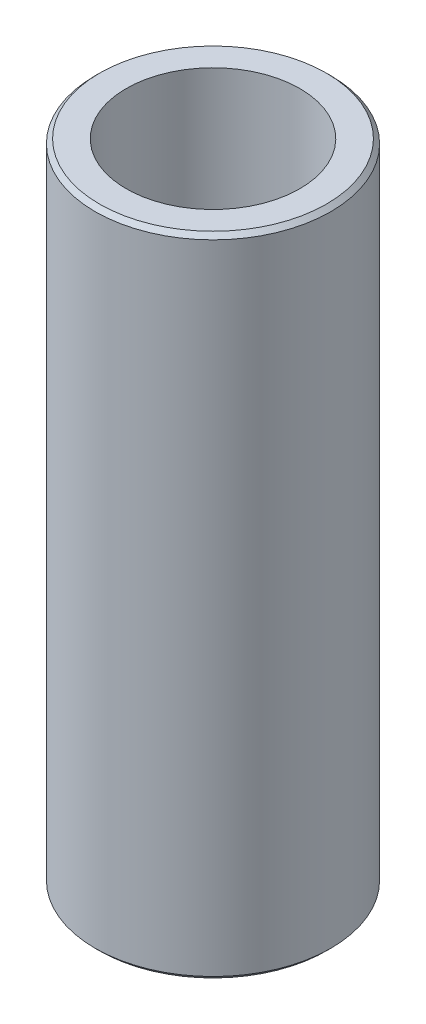
ISO-10303-21;
HEADER;
FILE_DESCRIPTION(('STEP AP214'),'2;1');
FILE_NAME('part.step','',(''),(''),'','','');
FILE_SCHEMA(('AUTOMOTIVE_DESIGN { 1 0 10303 214 1 1 1 1 }'));
ENDSEC;
DATA;
#1=APPLICATION_CONTEXT('core data for automotive mechanical design processes');
#2=APPLICATION_PROTOCOL_DEFINITION('international standard','automotive_design',2000,#1);
#3=PRODUCT_CONTEXT('',#1,'mechanical');
#4=PRODUCT('Part','Part','',(#3));
#5=PRODUCT_RELATED_PRODUCT_CATEGORY('part','',(#4));
#6=PRODUCT_DEFINITION_FORMATION('','',#4);
#7=PRODUCT_DEFINITION_CONTEXT('part definition',#1,'design');
#8=PRODUCT_DEFINITION('design','',#6,#7);
#9=PRODUCT_DEFINITION_SHAPE('','',#8);
#10=(LENGTH_UNIT() NAMED_UNIT(*) SI_UNIT(.MILLI.,.METRE.));
#11=(NAMED_UNIT(*) PLANE_ANGLE_UNIT() SI_UNIT($,.RADIAN.));
#12=(NAMED_UNIT(*) SI_UNIT($,.STERADIAN.) SOLID_ANGLE_UNIT());
#13=UNCERTAINTY_MEASURE_WITH_UNIT(LENGTH_MEASURE(1.E-05),#10,'distance_accuracy_value','');
#14=(GEOMETRIC_REPRESENTATION_CONTEXT(3) GLOBAL_UNCERTAINTY_ASSIGNED_CONTEXT((#13)) GLOBAL_UNIT_ASSIGNED_CONTEXT((#10,
#11,#12)) REPRESENTATION_CONTEXT('',''));
#15=CARTESIAN_POINT('',(0.,0.,0.));
#16=DIRECTION('',(0.,0.,1.));
#17=DIRECTION('',(1.,0.,0.));
#18=AXIS2_PLACEMENT_3D('',#15,#16,#17);
#19=CARTESIAN_POINT('',(0.,219.55414435499,0.));
#20=DIRECTION('',(0.,-1.,0.));
#21=DIRECTION('',(0.,0.,-1.));
#22=AXIS2_PLACEMENT_3D('',#19,#20,#21);
#23=CYLINDRICAL_SURFACE('',#22,40.);
#24=CARTESIAN_POINT('',(0.,218.068885232249,0.));
#25=DIRECTION('',(0.,1.,0.));
#26=DIRECTION('',(0.,0.,1.));
#27=AXIS2_PLACEMENT_3D('',#24,#25,#26);
#28=CIRCLE('',#27,40.);
#29=CARTESIAN_POINT('',(0.,218.068885232249,-40.));
#30=VERTEX_POINT('',#29);
#31=EDGE_CURVE('E50',#30,#30,#28,.F.);
#32=CARTESIAN_POINT('',(0.,1.48525912274092,0.));
#33=DIRECTION('',(0.,1.,0.));
#34=DIRECTION('',(0.,0.,1.));
#35=AXIS2_PLACEMENT_3D('',#32,#33,#34);
#36=CIRCLE('',#35,40.);
#37=CARTESIAN_POINT('',(0.,1.48525912274092,-40.));
#38=VERTEX_POINT('',#37);
#39=EDGE_CURVE('E51',#38,#38,#36,.T.);
#40=CARTESIAN_POINT('',(0.,218.068885232249,-40.));
#41=CARTESIAN_POINT('',(0.,215.812805793609,-40.));
#42=CARTESIAN_POINT('',(0.,213.556726354968,-40.));
#43=CARTESIAN_POINT('',(0.,209.044567477686,-40.));
#44=CARTESIAN_POINT('',(0.,206.788488039046,-40.));
#45=CARTESIAN_POINT('',(0.,202.276329161764,-40.));
#46=CARTESIAN_POINT('',(0.,200.020249723124,-40.));
#47=CARTESIAN_POINT('',(0.,195.508090845842,-40.));
#48=CARTESIAN_POINT('',(0.,193.252011407201,-40.));
#49=CARTESIAN_POINT('',(0.,188.73985252992,-40.));
#50=CARTESIAN_POINT('',(0.,186.483773091279,-40.));
#51=CARTESIAN_POINT('',(0.,181.971614213998,-40.));
#52=CARTESIAN_POINT('',(0.,179.715534775357,-40.));
#53=CARTESIAN_POINT('',(0.,175.203375898076,-40.));
#54=CARTESIAN_POINT('',(0.,172.947296459435,-40.));
#55=CARTESIAN_POINT('',(0.,168.435137582154,-40.));
#56=CARTESIAN_POINT('',(0.,166.179058143513,-40.));
#57=CARTESIAN_POINT('',(0.,161.666899266232,-40.));
#58=CARTESIAN_POINT('',(0.,159.410819827591,-40.));
#59=CARTESIAN_POINT('',(0.,154.898660950309,-40.));
#60=CARTESIAN_POINT('',(0.,152.642581511669,-40.));
#61=CARTESIAN_POINT('',(0.,148.130422634387,-40.));
#62=CARTESIAN_POINT('',(0.,145.874343195747,-40.));
#63=CARTESIAN_POINT('',(0.,141.362184318465,-40.));
#64=CARTESIAN_POINT('',(0.,139.106104879824,-40.));
#65=CARTESIAN_POINT('',(0.,134.593946002543,-40.));
#66=CARTESIAN_POINT('',(0.,132.337866563902,-40.));
#67=CARTESIAN_POINT('',(0.,127.825707686621,-40.));
#68=CARTESIAN_POINT('',(0.,125.56962824798,-40.));
#69=CARTESIAN_POINT('',(0.,121.057469370699,-40.));
#70=CARTESIAN_POINT('',(0.,118.801389932058,-40.));
#71=CARTESIAN_POINT('',(0.,114.289231054777,-40.));
#72=CARTESIAN_POINT('',(0.,112.033151616136,-40.));
#73=CARTESIAN_POINT('',(0.,107.520992738854,-40.));
#74=CARTESIAN_POINT('',(0.,105.264913300214,-40.));
#75=CARTESIAN_POINT('',(0.,100.752754422932,-40.));
#76=CARTESIAN_POINT('',(0.,98.4966749842916,-40.));
#77=CARTESIAN_POINT('',(0.,93.9845161070101,-40.));
#78=CARTESIAN_POINT('',(0.,91.7284366683694,-40.));
#79=CARTESIAN_POINT('',(0.,87.216277791088,-40.));
#80=CARTESIAN_POINT('',(0.,84.9601983524473,-40.));
#81=CARTESIAN_POINT('',(0.,80.4480394751659,-40.));
#82=CARTESIAN_POINT('',(0.,78.1919600365251,-40.));
#83=CARTESIAN_POINT('',(0.,73.6798011592437,-40.));
#84=CARTESIAN_POINT('',(0.,71.423721720603,-40.));
#85=CARTESIAN_POINT('',(0.,66.9115628433216,-40.));
#86=CARTESIAN_POINT('',(0.,64.6554834046809,-40.));
#87=CARTESIAN_POINT('',(0.,60.1433245273995,-40.));
#88=CARTESIAN_POINT('',(0.,57.8872450887587,-40.));
#89=CARTESIAN_POINT('',(0.,53.3750862114773,-40.));
#90=CARTESIAN_POINT('',(0.,51.1190067728366,-40.));
#91=CARTESIAN_POINT('',(0.,46.6068478955552,-40.));
#92=CARTESIAN_POINT('',(0.,44.3507684569145,-40.));
#93=CARTESIAN_POINT('',(0.,39.838609579633,-40.));
#94=CARTESIAN_POINT('',(0.,37.5825301409923,-40.));
#95=CARTESIAN_POINT('',(0.,33.0703712637109,-40.));
#96=CARTESIAN_POINT('',(0.,30.8142918250702,-40.));
#97=CARTESIAN_POINT('',(0.,26.3021329477888,-40.));
#98=CARTESIAN_POINT('',(0.,24.0460535091481,-40.));
#99=CARTESIAN_POINT('',(0.,19.5338946318666,-40.));
#100=CARTESIAN_POINT('',(0.,17.2778151932259,-40.));
#101=CARTESIAN_POINT('',(0.,12.7656563159445,-40.));
#102=CARTESIAN_POINT('',(0.,10.5095768773038,-40.));
#103=CARTESIAN_POINT('',(0.,5.99741800002234,-40.));
#104=CARTESIAN_POINT('',(0.,3.74133856138163,-40.));
#105=CARTESIAN_POINT('',(0.,1.48525912274092,-40.));
#106=B_SPLINE_CURVE_WITH_KNOTS('',3,(#40,#41,#42,#43,#44,#45,#46,#47,#48,#49,#50,#51,#52,#53,
#54,#55,#56,#57,#58,#59,#60,#61,#62,#63,#64,#65,#66,#67,#68,#69,#70,#71,#72,#73,#74,#75,#76,#77,
#78,#79,#80,#81,#82,#83,#84,#85,#86,#87,#88,#89,#90,#91,#92,#93,#94,#95,#96,#97,#98,#99,#100,
#101,#102,#103,#104,#105),.UNSPECIFIED.,.F.,.F.,(4,2,2,2,2,2,2,2,2,2,2,2,2,2,2,2,2,2,2,2,2,2,2,
2,2,2,2,2,2,2,2,2,4),(0.,6.76823831592213,13.5364766318443,20.3047149477664,27.0729532636885,
33.8411915796107,40.6094298955328,47.3776682114549,54.1459065273771,60.9141448432992,
67.6823831592213,74.4506214751435,81.2188597910656,87.9870981069878,94.7553364229099,
101.523574738832,108.291813054754,115.060051370676,121.828289686598,128.596528002521,
135.364766318443,142.133004634365,148.901242950287,155.669481266209,162.437719582131,
169.205957898053,175.974196213976,182.742434529898,189.51067284582,196.278911161742,
203.047149477664,209.815387793586,216.583626109508),.UNSPECIFIED.);
#107=EDGE_CURVE('BSEAM39',#30,#38,#106,.T.);
#108=ORIENTED_EDGE('',*,*,#31,.T.);
#109=ORIENTED_EDGE('',*,*,#39,.T.);
#110=ORIENTED_EDGE('',*,*,#107,.T.);
#111=ORIENTED_EDGE('',*,*,#107,.F.);
#112=EDGE_LOOP('',(#108,#110,#109,#111));
#113=FACE_BOUND('',#112,.T.);
#114=ADVANCED_FACE('F39',(#113),#23,.T.);
#115=CARTESIAN_POINT('',(0.,219.55414435499,0.));
#116=DIRECTION('',(0.,1.,0.));
#117=DIRECTION('',(0.,0.,1.));
#118=AXIS2_PLACEMENT_3D('',#115,#116,#117);
#119=PLANE('',#118);
#120=CARTESIAN_POINT('',(0.,219.55414435499,0.));
#121=DIRECTION('',(0.,1.,0.));
#122=DIRECTION('',(0.,0.,1.));
#123=AXIS2_PLACEMENT_3D('',#120,#121,#122);
#124=CIRCLE('',#123,38.5147408772595);
#125=CARTESIAN_POINT('',(0.,219.55414435499,38.5147408772595));
#126=VERTEX_POINT('',#125);
#127=EDGE_CURVE('E54',#126,#126,#124,.T.);
#128=ORIENTED_EDGE('',*,*,#127,.T.);
#129=EDGE_LOOP('',(#128));
#130=FACE_BOUND('',#129,.T.);
#131=CARTESIAN_POINT('',(0.,219.55414435499,0.));
#132=DIRECTION('',(0.,1.,0.));
#133=DIRECTION('',(0.,0.,1.));
#134=AXIS2_PLACEMENT_3D('',#131,#132,#133);
#135=CIRCLE('',#134,29.4788693934168);
#136=CARTESIAN_POINT('',(0.,219.55414435499,-29.4788693934168));
#137=VERTEX_POINT('',#136);
#138=EDGE_CURVE('E58',#137,#137,#135,.T.);
#139=ORIENTED_EDGE('',*,*,#138,.F.);
#140=EDGE_LOOP('',(#139));
#141=FACE_BOUND('',#140,.T.);
#142=ADVANCED_FACE('F69',(#130,#141),#119,.T.);
#143=CARTESIAN_POINT('',(0.,0.,0.));
#144=DIRECTION('',(0.,1.,0.));
#145=DIRECTION('',(0.,0.,1.));
#146=AXIS2_PLACEMENT_3D('',#143,#144,#145);
#147=PLANE('',#146);
#148=CARTESIAN_POINT('',(0.,0.,0.));
#149=DIRECTION('',(0.,1.,0.));
#150=DIRECTION('',(0.,0.,1.));
#151=AXIS2_PLACEMENT_3D('',#148,#149,#150);
#152=CIRCLE('',#151,38.5147408772591);
#153=CARTESIAN_POINT('',(0.,0.,38.5147408772591));
#154=VERTEX_POINT('',#153);
#155=EDGE_CURVE('E10',#154,#154,#152,.F.);
#156=ORIENTED_EDGE('',*,*,#155,.T.);
#157=EDGE_LOOP('',(#156));
#158=FACE_BOUND('',#157,.T.);
#159=CARTESIAN_POINT('',(0.,0.,0.));
#160=DIRECTION('',(0.,1.,0.));
#161=DIRECTION('',(0.,0.,1.));
#162=AXIS2_PLACEMENT_3D('',#159,#160,#161);
#163=CIRCLE('',#162,29.4788693934168);
#164=CARTESIAN_POINT('',(0.,0.,-29.4788693934168));
#165=VERTEX_POINT('',#164);
#166=EDGE_CURVE('E63',#165,#165,#163,.T.);
#167=ORIENTED_EDGE('',*,*,#166,.T.);
#168=EDGE_LOOP('',(#167));
#169=FACE_BOUND('',#168,.T.);
#170=ADVANCED_FACE('F75',(#158,#169),#147,.F.);
#171=CARTESIAN_POINT('',(0.,219.55414435499,0.));
#172=DIRECTION('',(0.,-1.,0.));
#173=DIRECTION('',(0.,0.,-1.));
#174=AXIS2_PLACEMENT_3D('',#171,#172,#173);
#175=CYLINDRICAL_SURFACE('',#174,29.4788693934168);
#176=CARTESIAN_POINT('',(0.,219.55414435499,-29.4788693934168));
#177=CARTESIAN_POINT('',(0.,217.267122017959,-29.4788693934168));
#178=CARTESIAN_POINT('',(0.,214.980099680928,-29.4788693934168));
#179=CARTESIAN_POINT('',(0.,210.406055006865,-29.4788693934168));
#180=CARTESIAN_POINT('',(0.,208.119032669834,-29.4788693934168));
#181=CARTESIAN_POINT('',(0.,203.544987995772,-29.4788693934168));
#182=CARTESIAN_POINT('',(0.,201.257965658741,-29.4788693934168));
#183=CARTESIAN_POINT('',(0.,196.683920984678,-29.4788693934168));
#184=CARTESIAN_POINT('',(0.,194.396898647647,-29.4788693934168));
#185=CARTESIAN_POINT('',(0.,189.822853973585,-29.4788693934168));
#186=CARTESIAN_POINT('',(0.,187.535831636554,-29.4788693934168));
#187=CARTESIAN_POINT('',(0.,182.961786962492,-29.4788693934168));
#188=CARTESIAN_POINT('',(0.,180.67476462546,-29.4788693934168));
#189=CARTESIAN_POINT('',(0.,176.100719951398,-29.4788693934168));
#190=CARTESIAN_POINT('',(0.,173.813697614367,-29.4788693934168));
#191=CARTESIAN_POINT('',(0.,169.239652940305,-29.4788693934168));
#192=CARTESIAN_POINT('',(0.,166.952630603274,-29.4788693934168));
#193=CARTESIAN_POINT('',(0.,162.378585929211,-29.4788693934168));
#194=CARTESIAN_POINT('',(0.,160.09156359218,-29.4788693934168));
#195=CARTESIAN_POINT('',(0.,155.517518918118,-29.4788693934168));
#196=CARTESIAN_POINT('',(0.,153.230496581087,-29.4788693934168));
#197=CARTESIAN_POINT('',(0.,148.656451907024,-29.4788693934168));
#198=CARTESIAN_POINT('',(0.,146.369429569993,-29.4788693934168));
#199=CARTESIAN_POINT('',(0.,141.795384895931,-29.4788693934168));
#200=CARTESIAN_POINT('',(0.,139.5083625589,-29.4788693934168));
#201=CARTESIAN_POINT('',(0.,134.934317884837,-29.4788693934168));
#202=CARTESIAN_POINT('',(0.,132.647295547806,-29.4788693934168));
#203=CARTESIAN_POINT('',(0.,128.073250873744,-29.4788693934168));
#204=CARTESIAN_POINT('',(0.,125.786228536713,-29.4788693934168));
#205=CARTESIAN_POINT('',(0.,121.212183862651,-29.4788693934168));
#206=CARTESIAN_POINT('',(0.,118.92516152562,-29.4788693934168));
#207=CARTESIAN_POINT('',(0.,114.351116851557,-29.4788693934168));
#208=CARTESIAN_POINT('',(0.,112.064094514526,-29.4788693934168));
#209=CARTESIAN_POINT('',(0.,107.490049840464,-29.4788693934168));
#210=CARTESIAN_POINT('',(0.,105.203027503433,-29.4788693934168));
#211=CARTESIAN_POINT('',(0.,100.62898282937,-29.4788693934168));
#212=CARTESIAN_POINT('',(0.,98.3419604923392,-29.4788693934168));
#213=CARTESIAN_POINT('',(0.,93.7679158182769,-29.4788693934168));
#214=CARTESIAN_POINT('',(0.,91.4808934812458,-29.4788693934168));
#215=CARTESIAN_POINT('',(0.,86.9068488071835,-29.4788693934168));
#216=CARTESIAN_POINT('',(0.,84.6198264701523,-29.4788693934168));
#217=CARTESIAN_POINT('',(0.,80.0457817960901,-29.4788693934168));
#218=CARTESIAN_POINT('',(0.,77.7587594590589,-29.4788693934168));
#219=CARTESIAN_POINT('',(0.,73.1847147849966,-29.4788693934168));
#220=CARTESIAN_POINT('',(0.,70.8976924479655,-29.4788693934168));
#221=CARTESIAN_POINT('',(0.,66.3236477739032,-29.4788693934168));
#222=CARTESIAN_POINT('',(0.,64.036625436872,-29.4788693934168));
#223=CARTESIAN_POINT('',(0.,59.4625807628097,-29.4788693934168));
#224=CARTESIAN_POINT('',(0.,57.1755584257786,-29.4788693934168));
#225=CARTESIAN_POINT('',(0.,52.6015137517163,-29.4788693934168));
#226=CARTESIAN_POINT('',(0.,50.3144914146852,-29.4788693934168));
#227=CARTESIAN_POINT('',(0.,45.7404467406229,-29.4788693934168));
#228=CARTESIAN_POINT('',(0.,43.4534244035917,-29.4788693934168));
#229=CARTESIAN_POINT('',(0.,38.8793797295294,-29.4788693934168));
#230=CARTESIAN_POINT('',(0.,36.5923573924983,-29.4788693934168));
#231=CARTESIAN_POINT('',(0.,32.018312718436,-29.4788693934168));
#232=CARTESIAN_POINT('',(0.,29.7312903814049,-29.4788693934168));
#233=CARTESIAN_POINT('',(0.,25.1572457073426,-29.4788693934168));
#234=CARTESIAN_POINT('',(0.,22.8702233703114,-29.4788693934168));
#235=CARTESIAN_POINT('',(0.,18.2961786962491,-29.4788693934168));
#236=CARTESIAN_POINT('',(0.,16.009156359218,-29.4788693934168));
#237=CARTESIAN_POINT('',(0.,11.4351116851557,-29.4788693934168));
#238=CARTESIAN_POINT('',(0.,9.14808934812454,-29.4788693934168));
#239=CARTESIAN_POINT('',(0.,4.57404467406226,-29.4788693934168));
#240=CARTESIAN_POINT('',(0.,2.28702233703112,-29.4788693934168));
#241=CARTESIAN_POINT('',(0.,0.,-29.4788693934168));
#242=B_SPLINE_CURVE_WITH_KNOTS('',3,(#176,#177,#178,#179,#180,#181,#182,#183,#184,#185,#186,
#187,#188,#189,#190,#191,#192,#193,#194,#195,#196,#197,#198,#199,#200,#201,#202,#203,#204,#205,
#206,#207,#208,#209,#210,#211,#212,#213,#214,#215,#216,#217,#218,#219,#220,#221,#222,#223,#224,
#225,#226,#227,#228,#229,#230,#231,#232,#233,#234,#235,#236,#237,#238,#239,#240,#241),
.UNSPECIFIED.,.F.,.F.,(4,2,2,2,2,2,2,2,2,2,2,2,2,2,2,2,2,2,2,2,2,2,2,2,2,2,2,2,2,2,2,2,4),(0.,
6.86106701109343,13.7221340221869,20.5832010332803,27.4442680443737,34.3053350554672,
41.1664020665606,48.027469077654,54.8885360887475,61.7496030998409,68.6106701109343,
75.4717371220277,82.3328041331212,89.1938711442146,96.0549381553081,102.916005166401,
109.777072177495,116.638139188588,123.499206199682,130.360273210775,137.221340221869,
144.082407232962,150.943474244056,157.804541255149,164.665608266242,171.526675277336,
178.387742288429,185.248809299523,192.109876310616,198.97094332171,205.832010332803,
212.693077343896,219.55414435499),.UNSPECIFIED.);
#243=EDGE_CURVE('BSEAM70',#137,#165,#242,.T.);
#244=ORIENTED_EDGE('',*,*,#138,.T.);
#245=ORIENTED_EDGE('',*,*,#166,.F.);
#246=ORIENTED_EDGE('',*,*,#243,.T.);
#247=ORIENTED_EDGE('',*,*,#243,.F.);
#248=EDGE_LOOP('',(#244,#246,#245,#247));
#249=FACE_BOUND('',#248,.T.);
#250=ADVANCED_FACE('F70',(#249),#175,.F.);
#251=CARTESIAN_POINT('',(0.,219.55414435499,0.));
#252=DIRECTION('',(0.,-1.,0.));
#253=DIRECTION('',(0.,0.,-1.));
#254=AXIS2_PLACEMENT_3D('',#251,#252,#253);
#255=CONICAL_SURFACE('',#254,38.5147408772595,0.785398163397439);
#256=ORIENTED_EDGE('',*,*,#31,.F.);
#257=EDGE_LOOP('',(#256));
#258=FACE_BOUND('',#257,.T.);
#259=ORIENTED_EDGE('',*,*,#127,.F.);
#260=EDGE_LOOP('',(#259));
#261=FACE_BOUND('',#260,.T.);
#262=ADVANCED_FACE('F81',(#258,#261),#255,.T.);
#263=CARTESIAN_POINT('',(0.,1.48525912274092,0.));
#264=DIRECTION('',(0.,1.,0.));
#265=DIRECTION('',(0.,0.,1.));
#266=AXIS2_PLACEMENT_3D('',#263,#264,#265);
#267=CONICAL_SURFACE('',#266,40.,0.785398163397448);
#268=ORIENTED_EDGE('',*,*,#155,.F.);
#269=EDGE_LOOP('',(#268));
#270=FACE_BOUND('',#269,.T.);
#271=ORIENTED_EDGE('',*,*,#39,.F.);
#272=EDGE_LOOP('',(#271));
#273=FACE_BOUND('',#272,.T.);
#274=ADVANCED_FACE('F45',(#270,#273),#267,.T.);
#275=CLOSED_SHELL('',(#114,#142,#170,#250,#262,#274));
#276=MANIFOLD_SOLID_BREP('B2',#275);
#277=ADVANCED_BREP_SHAPE_REPRESENTATION('',(#18,#276),#14);
#278=SHAPE_DEFINITION_REPRESENTATION(#9,#277);
ENDSEC;
END-ISO-10303-21;
